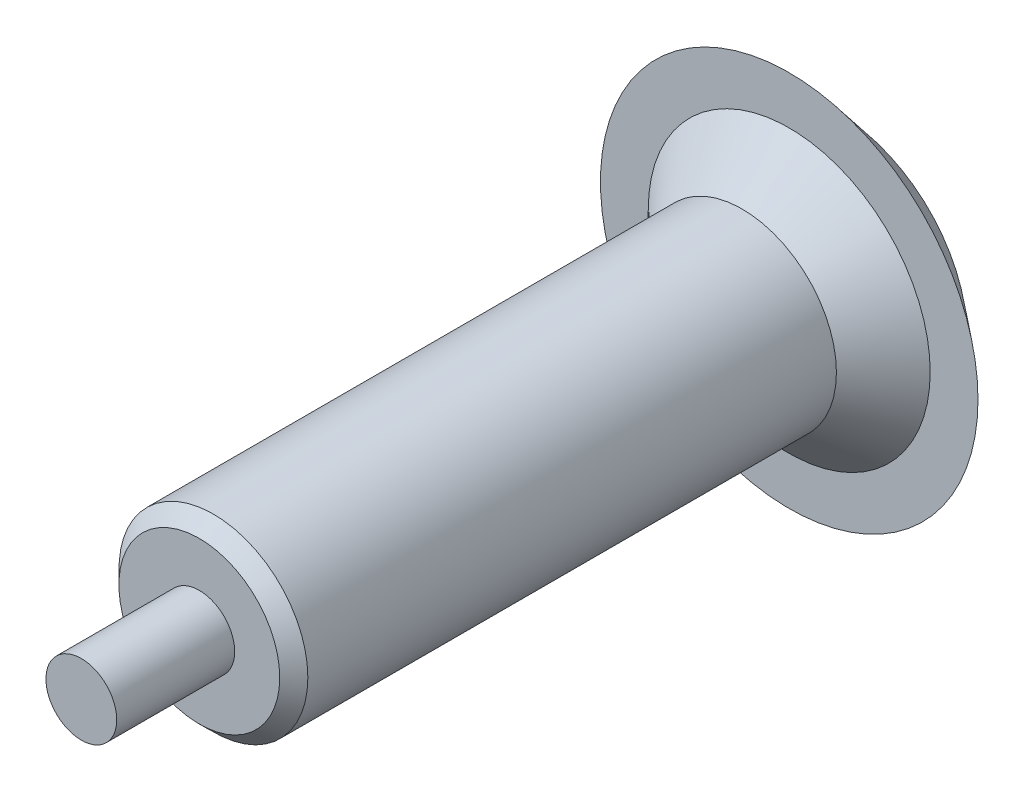
ISO-10303-21;
HEADER;
FILE_DESCRIPTION(('STEP AP214'),'2;1');
FILE_NAME('part.step','',(''),(''),'','','');
FILE_SCHEMA(('AUTOMOTIVE_DESIGN { 1 0 10303 214 1 1 1 1 }'));
ENDSEC;
DATA;
#1=APPLICATION_CONTEXT('core data for automotive mechanical design processes');
#2=APPLICATION_PROTOCOL_DEFINITION('international standard','automotive_design',2000,#1);
#3=PRODUCT_CONTEXT('',#1,'mechanical');
#4=PRODUCT('Part','Part','',(#3));
#5=PRODUCT_RELATED_PRODUCT_CATEGORY('part','',(#4));
#6=PRODUCT_DEFINITION_FORMATION('','',#4);
#7=PRODUCT_DEFINITION_CONTEXT('part definition',#1,'design');
#8=PRODUCT_DEFINITION('design','',#6,#7);
#9=PRODUCT_DEFINITION_SHAPE('','',#8);
#10=(LENGTH_UNIT() NAMED_UNIT(*) SI_UNIT(.MILLI.,.METRE.));
#11=(NAMED_UNIT(*) PLANE_ANGLE_UNIT() SI_UNIT($,.RADIAN.));
#12=(NAMED_UNIT(*) SI_UNIT($,.STERADIAN.) SOLID_ANGLE_UNIT());
#13=UNCERTAINTY_MEASURE_WITH_UNIT(LENGTH_MEASURE(1.E-05),#10,'distance_accuracy_value','');
#14=(GEOMETRIC_REPRESENTATION_CONTEXT(3) GLOBAL_UNCERTAINTY_ASSIGNED_CONTEXT((#13)) GLOBAL_UNIT_ASSIGNED_CONTEXT((#10,
#11,#12)) REPRESENTATION_CONTEXT('',''));
#15=CARTESIAN_POINT('',(0.,0.,0.));
#16=DIRECTION('',(0.,0.,1.));
#17=DIRECTION('',(1.,0.,0.));
#18=AXIS2_PLACEMENT_3D('',#15,#16,#17);
#19=CARTESIAN_POINT('',(0.,0.,-163.909895321136));
#20=DIRECTION('',(0.,0.,-1.));
#21=DIRECTION('',(-1.,0.,0.));
#22=AXIS2_PLACEMENT_3D('',#19,#20,#21);
#23=PLANE('',#22);
#24=CARTESIAN_POINT('',(0.,0.,-163.909895321136));
#25=DIRECTION('',(0.,0.,1.));
#26=DIRECTION('',(1.,0.,0.));
#27=AXIS2_PLACEMENT_3D('',#24,#25,#26);
#28=CIRCLE('',#27,27.7865362558436);
#29=CARTESIAN_POINT('',(27.7865362558436,0.,-163.909895321136));
#30=VERTEX_POINT('',#29);
#31=EDGE_CURVE('E10',#30,#30,#28,.T.);
#32=ORIENTED_EDGE('',*,*,#31,.F.);
#33=EDGE_LOOP('',(#32));
#34=FACE_BOUND('',#33,.T.);
#35=ADVANCED_FACE('F30',(#34),#23,.T.);
#36=CARTESIAN_POINT('',(0.,0.,-153.909895321136));
#37=DIRECTION('',(0.,0.,1.));
#38=DIRECTION('',(1.,0.,0.));
#39=AXIS2_PLACEMENT_3D('',#36,#37,#38);
#40=CONICAL_SURFACE('',#39,40.,0.884715458783593);
#41=ORIENTED_EDGE('',*,*,#31,.T.);
#42=EDGE_LOOP('',(#41));
#43=FACE_BOUND('',#42,.T.);
#44=CARTESIAN_POINT('',(0.,0.,-153.909895321136));
#45=DIRECTION('',(0.,0.,1.));
#46=DIRECTION('',(1.,0.,0.));
#47=AXIS2_PLACEMENT_3D('',#44,#45,#46);
#48=CIRCLE('',#47,40.);
#49=CARTESIAN_POINT('',(40.,0.,-153.909895321136));
#50=VERTEX_POINT('',#49);
#51=EDGE_CURVE('E36',#50,#50,#48,.T.);
#52=ORIENTED_EDGE('',*,*,#51,.F.);
#53=EDGE_LOOP('',(#52));
#54=FACE_BOUND('',#53,.T.);
#55=ADVANCED_FACE('F78',(#43,#54),#40,.T.);
#56=CARTESIAN_POINT('',(40.,0.,-153.909895321136));
#57=DIRECTION('',(0.,0.,1.));
#58=DIRECTION('',(1.,0.,0.));
#59=AXIS2_PLACEMENT_3D('',#56,#57,#58);
#60=PLANE('',#59);
#61=ORIENTED_EDGE('',*,*,#51,.T.);
#62=EDGE_LOOP('',(#61));
#63=FACE_BOUND('',#62,.T.);
#64=CARTESIAN_POINT('',(0.,0.,-153.909895321136));
#65=DIRECTION('',(0.,0.,1.));
#66=DIRECTION('',(1.,0.,0.));
#67=AXIS2_PLACEMENT_3D('',#64,#65,#66);
#68=CIRCLE('',#67,29.8694656518435);
#69=CARTESIAN_POINT('',(29.8694656518435,0.,-153.909895321136));
#70=VERTEX_POINT('',#69);
#71=EDGE_CURVE('E40',#70,#70,#68,.T.);
#72=ORIENTED_EDGE('',*,*,#71,.F.);
#73=EDGE_LOOP('',(#72));
#74=FACE_BOUND('',#73,.T.);
#75=ADVANCED_FACE('F83',(#63,#74),#60,.T.);
#76=CARTESIAN_POINT('',(0.,0.,-143.909895321136));
#77=DIRECTION('',(0.,0.,-1.));
#78=DIRECTION('',(-1.,0.,0.));
#79=AXIS2_PLACEMENT_3D('',#76,#77,#78);
#80=CONICAL_SURFACE('',#79,20.,0.778828662608831);
#81=ORIENTED_EDGE('',*,*,#71,.T.);
#82=EDGE_LOOP('',(#81));
#83=FACE_BOUND('',#82,.T.);
#84=CARTESIAN_POINT('',(0.,0.,-143.909895321136));
#85=DIRECTION('',(0.,0.,1.));
#86=DIRECTION('',(1.,0.,0.));
#87=AXIS2_PLACEMENT_3D('',#84,#85,#86);
#88=CIRCLE('',#87,20.);
#89=CARTESIAN_POINT('',(20.,0.,-143.909895321136));
#90=VERTEX_POINT('',#89);
#91=EDGE_CURVE('E44',#90,#90,#88,.T.);
#92=ORIENTED_EDGE('',*,*,#91,.F.);
#93=EDGE_LOOP('',(#92));
#94=FACE_BOUND('',#93,.T.);
#95=ADVANCED_FACE('F87',(#83,#94),#80,.T.);
#96=CARTESIAN_POINT('',(0.,0.,0.));
#97=DIRECTION('',(0.,0.,1.));
#98=DIRECTION('',(1.,0.,0.));
#99=AXIS2_PLACEMENT_3D('',#96,#97,#98);
#100=CYLINDRICAL_SURFACE('',#99,20.);
#101=ORIENTED_EDGE('',*,*,#91,.T.);
#102=EDGE_LOOP('',(#101));
#103=FACE_BOUND('',#102,.T.);
#104=CARTESIAN_POINT('',(0.,0.,-31.9098953211361));
#105=DIRECTION('',(0.,0.,1.));
#106=DIRECTION('',(1.,0.,0.));
#107=AXIS2_PLACEMENT_3D('',#104,#105,#106);
#108=CIRCLE('',#107,20.);
#109=CARTESIAN_POINT('',(20.,0.,-31.9098953211361));
#110=VERTEX_POINT('',#109);
#111=EDGE_CURVE('E49',#110,#110,#108,.T.);
#112=ORIENTED_EDGE('',*,*,#111,.F.);
#113=EDGE_LOOP('',(#112));
#114=FACE_BOUND('',#113,.T.);
#115=ADVANCED_FACE('F93',(#103,#114),#100,.T.);
#116=CARTESIAN_POINT('',(0.,0.,-28.9098953211361));
#117=DIRECTION('',(0.,0.,-1.));
#118=DIRECTION('',(-1.,0.,0.));
#119=AXIS2_PLACEMENT_3D('',#116,#117,#118);
#120=CONICAL_SURFACE('',#119,17.039160304447,0.778828662608829);
#121=ORIENTED_EDGE('',*,*,#111,.T.);
#122=EDGE_LOOP('',(#121));
#123=FACE_BOUND('',#122,.T.);
#124=CARTESIAN_POINT('',(0.,0.,-28.9098953211361));
#125=DIRECTION('',(0.,0.,1.));
#126=DIRECTION('',(1.,0.,0.));
#127=AXIS2_PLACEMENT_3D('',#124,#125,#126);
#128=CIRCLE('',#127,17.039160304447);
#129=CARTESIAN_POINT('',(17.039160304447,0.,-28.9098953211361));
#130=VERTEX_POINT('',#129);
#131=EDGE_CURVE('E52',#130,#130,#128,.T.);
#132=ORIENTED_EDGE('',*,*,#131,.F.);
#133=EDGE_LOOP('',(#132));
#134=FACE_BOUND('',#133,.T.);
#135=ADVANCED_FACE('F74',(#123,#134),#120,.T.);
#136=CARTESIAN_POINT('',(17.039160304447,0.,-28.9098953211361));
#137=DIRECTION('',(0.,0.,1.));
#138=DIRECTION('',(1.,0.,0.));
#139=AXIS2_PLACEMENT_3D('',#136,#137,#138);
#140=PLANE('',#139);
#141=ORIENTED_EDGE('',*,*,#131,.T.);
#142=EDGE_LOOP('',(#141));
#143=FACE_BOUND('',#142,.T.);
#144=CARTESIAN_POINT('',(0.,0.,-28.9098953211361));
#145=DIRECTION('',(0.,0.,1.));
#146=DIRECTION('',(1.,0.,0.));
#147=AXIS2_PLACEMENT_3D('',#144,#145,#146);
#148=CIRCLE('',#147,7.5);
#149=CARTESIAN_POINT('',(7.5,0.,-28.9098953211361));
#150=VERTEX_POINT('',#149);
#151=EDGE_CURVE('E55',#150,#150,#148,.T.);
#152=ORIENTED_EDGE('',*,*,#151,.F.);
#153=EDGE_LOOP('',(#152));
#154=FACE_BOUND('',#153,.T.);
#155=ADVANCED_FACE('F66',(#143,#154),#140,.T.);
#156=CARTESIAN_POINT('',(0.,0.,0.));
#157=DIRECTION('',(0.,0.,1.));
#158=DIRECTION('',(1.,0.,0.));
#159=AXIS2_PLACEMENT_3D('',#156,#157,#158);
#160=CYLINDRICAL_SURFACE('',#159,7.5);
#161=ORIENTED_EDGE('',*,*,#151,.T.);
#162=EDGE_LOOP('',(#161));
#163=FACE_BOUND('',#162,.T.);
#164=CARTESIAN_POINT('',(0.,0.,-3.90989532113613));
#165=DIRECTION('',(0.,0.,1.));
#166=DIRECTION('',(1.,0.,0.));
#167=AXIS2_PLACEMENT_3D('',#164,#165,#166);
#168=CIRCLE('',#167,7.5);
#169=CARTESIAN_POINT('',(7.5,0.,-3.90989532113613));
#170=VERTEX_POINT('',#169);
#171=EDGE_CURVE('E58',#170,#170,#168,.T.);
#172=ORIENTED_EDGE('',*,*,#171,.F.);
#173=EDGE_LOOP('',(#172));
#174=FACE_BOUND('',#173,.T.);
#175=ADVANCED_FACE('F64',(#163,#174),#160,.T.);
#176=CARTESIAN_POINT('',(7.5,0.,-3.90989532113612));
#177=DIRECTION('',(0.,0.,1.));
#178=DIRECTION('',(1.,0.,0.));
#179=AXIS2_PLACEMENT_3D('',#176,#177,#178);
#180=PLANE('',#179);
#181=ORIENTED_EDGE('',*,*,#171,.T.);
#182=EDGE_LOOP('',(#181));
#183=FACE_BOUND('',#182,.T.);
#184=ADVANCED_FACE('F62',(#183),#180,.T.);
#185=CLOSED_SHELL('',(#35,#55,#75,#95,#115,#135,#155,#175,#184));
#186=MANIFOLD_SOLID_BREP('B2',#185);
#187=ADVANCED_BREP_SHAPE_REPRESENTATION('',(#18,#186),#14);
#188=SHAPE_DEFINITION_REPRESENTATION(#9,#187);
ENDSEC;
END-ISO-10303-21;
